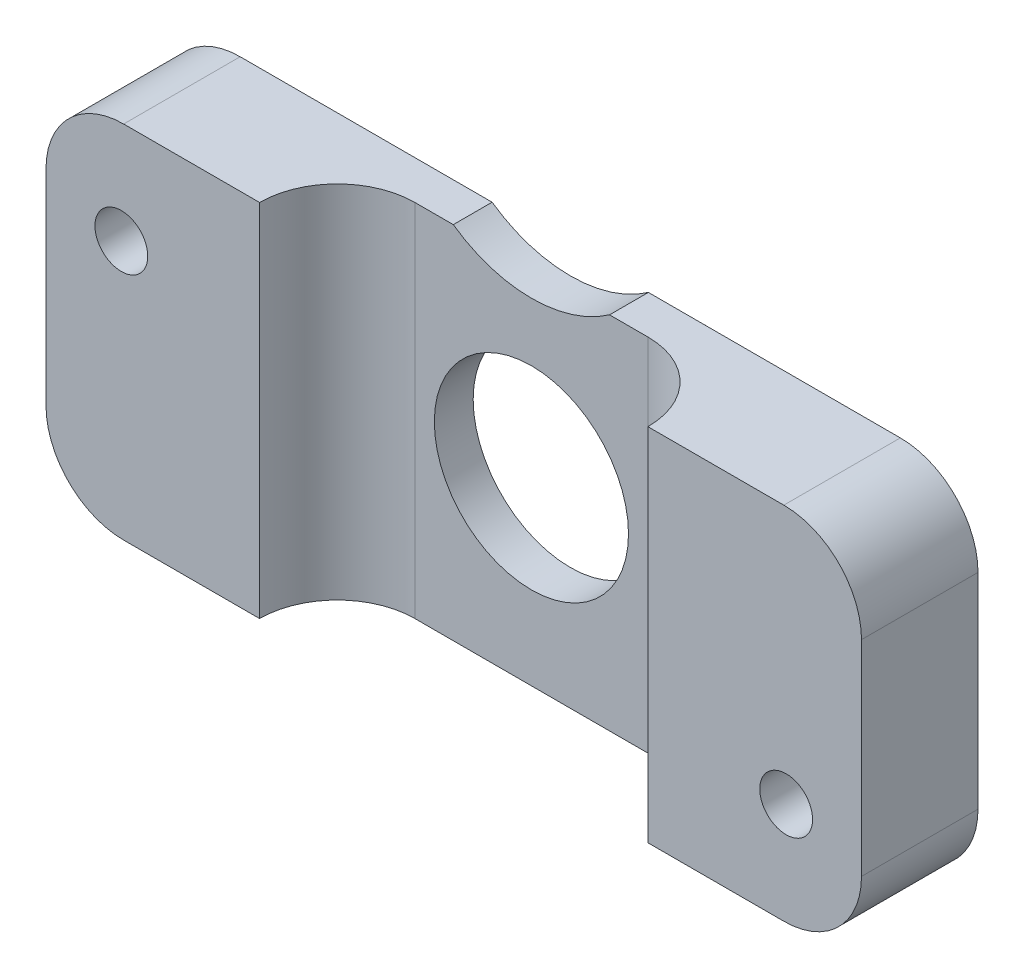
ISO-10303-21;
HEADER;
FILE_DESCRIPTION(('STEP AP214'),'2;1');
FILE_NAME('part.step','',(''),(''),'','','');
FILE_SCHEMA(('AUTOMOTIVE_DESIGN { 1 0 10303 214 1 1 1 1 }'));
ENDSEC;
DATA;
#1=APPLICATION_CONTEXT('core data for automotive mechanical design processes');
#2=APPLICATION_PROTOCOL_DEFINITION('international standard','automotive_design',2000,#1);
#3=PRODUCT_CONTEXT('',#1,'mechanical');
#4=PRODUCT('Part','Part','',(#3));
#5=PRODUCT_RELATED_PRODUCT_CATEGORY('part','',(#4));
#6=PRODUCT_DEFINITION_FORMATION('','',#4);
#7=PRODUCT_DEFINITION_CONTEXT('part definition',#1,'design');
#8=PRODUCT_DEFINITION('design','',#6,#7);
#9=PRODUCT_DEFINITION_SHAPE('','',#8);
#10=(LENGTH_UNIT() NAMED_UNIT(*) SI_UNIT(.MILLI.,.METRE.));
#11=(NAMED_UNIT(*) PLANE_ANGLE_UNIT() SI_UNIT($,.RADIAN.));
#12=(NAMED_UNIT(*) SI_UNIT($,.STERADIAN.) SOLID_ANGLE_UNIT());
#13=UNCERTAINTY_MEASURE_WITH_UNIT(LENGTH_MEASURE(1.E-05),#10,'distance_accuracy_value','');
#14=(GEOMETRIC_REPRESENTATION_CONTEXT(3) GLOBAL_UNCERTAINTY_ASSIGNED_CONTEXT((#13)) GLOBAL_UNIT_ASSIGNED_CONTEXT((#10,
#11,#12)) REPRESENTATION_CONTEXT('',''));
#15=CARTESIAN_POINT('',(0.,0.,0.));
#16=DIRECTION('',(0.,0.,1.));
#17=DIRECTION('',(1.,0.,0.));
#18=AXIS2_PLACEMENT_3D('',#15,#16,#17);
#19=CARTESIAN_POINT('',(-16.66875,7.366,1.5875));
#20=DIRECTION('',(0.,-1.,0.));
#21=DIRECTION('',(0.,0.,-1.));
#22=AXIS2_PLACEMENT_3D('',#19,#20,#21);
#23=PLANE('',#22);
#24=DIRECTION('',(-1.,0.,0.));
#25=VECTOR('',#24,1.);
#26=CARTESIAN_POINT('',(-16.66875,7.366,0.));
#27=LINE('',#26,#25);
#28=CARTESIAN_POINT('',(-3.19379750493046,7.366,0.));
#29=VERTEX_POINT('',#28);
#30=CARTESIAN_POINT('',(-13.49375,7.366,0.));
#31=VERTEX_POINT('',#30);
#32=EDGE_CURVE('E478',#29,#31,#27,.T.);
#33=ORIENTED_EDGE('',*,*,#32,.T.);
#34=DIRECTION('',(0.,0.,-1.));
#35=VECTOR('',#34,1.);
#36=CARTESIAN_POINT('',(-13.49375,7.366,1.5875));
#37=LINE('',#36,#35);
#38=CARTESIAN_POINT('',(-13.49375,7.366,4.7625));
#39=VERTEX_POINT('',#38);
#40=EDGE_CURVE('E11',#31,#39,#37,.F.);
#41=ORIENTED_EDGE('',*,*,#40,.T.);
#42=DIRECTION('',(-1.,0.,0.));
#43=VECTOR('',#42,1.);
#44=CARTESIAN_POINT('',(-7.9375,7.366,4.7625));
#45=LINE('',#44,#43);
#46=CARTESIAN_POINT('',(-7.9375,7.366,4.7625));
#47=VERTEX_POINT('',#46);
#48=EDGE_CURVE('E627',#47,#39,#45,.T.);
#49=ORIENTED_EDGE('',*,*,#48,.F.);
#50=CARTESIAN_POINT('',(-4.7625,7.366,4.7625));
#51=DIRECTION('',(0.,-1.,0.));
#52=DIRECTION('',(0.,0.,-1.));
#53=AXIS2_PLACEMENT_3D('',#50,#51,#52);
#54=CIRCLE('',#53,3.175);
#55=CARTESIAN_POINT('',(-4.7625,7.366,1.5875));
#56=VERTEX_POINT('',#55);
#57=EDGE_CURVE('E509',#47,#56,#54,.T.);
#58=ORIENTED_EDGE('',*,*,#57,.T.);
#59=DIRECTION('',(-1.,0.,0.));
#60=VECTOR('',#59,1.);
#61=CARTESIAN_POINT('',(-16.66875,7.366,1.5875));
#62=LINE('',#61,#60);
#63=CARTESIAN_POINT('',(-3.19379750493046,7.366,1.5875));
#64=VERTEX_POINT('',#63);
#65=EDGE_CURVE('E481',#64,#56,#62,.T.);
#66=ORIENTED_EDGE('',*,*,#65,.F.);
#67=DIRECTION('',(0.,0.,-1.));
#68=VECTOR('',#67,1.);
#69=CARTESIAN_POINT('',(-3.19379750493046,7.366,4.763525));
#70=LINE('',#69,#68);
#71=EDGE_CURVE('E466',#29,#64,#70,.F.);
#72=ORIENTED_EDGE('',*,*,#71,.F.);
#73=EDGE_LOOP('',(#33,#41,#49,#58,#66,#72));
#74=FACE_BOUND('',#73,.T.);
#75=ADVANCED_FACE('F360',(#74),#23,.F.);
#76=CARTESIAN_POINT('',(-16.66875,-7.366,1.5875));
#77=DIRECTION('',(0.,0.,1.));
#78=DIRECTION('',(1.,0.,0.));
#79=AXIS2_PLACEMENT_3D('',#76,#77,#78);
#80=PLANE('',#79);
#81=ORIENTED_EDGE('',*,*,#65,.T.);
#82=DIRECTION('',(0.,1.,0.));
#83=VECTOR('',#82,1.);
#84=CARTESIAN_POINT('',(-4.7625,-7.366,1.5875));
#85=LINE('',#84,#83);
#86=CARTESIAN_POINT('',(-4.7625,-7.366,1.5875));
#87=VERTEX_POINT('',#86);
#88=EDGE_CURVE('E507',#56,#87,#85,.F.);
#89=ORIENTED_EDGE('',*,*,#88,.T.);
#90=DIRECTION('',(1.,0.,0.));
#91=VECTOR('',#90,1.);
#92=CARTESIAN_POINT('',(-16.66875,-7.366,1.5875));
#93=LINE('',#92,#91);
#94=CARTESIAN_POINT('',(4.7625,-7.366,1.5875));
#95=VERTEX_POINT('',#94);
#96=EDGE_CURVE('E491',#87,#95,#93,.T.);
#97=ORIENTED_EDGE('',*,*,#96,.T.);
#98=DIRECTION('',(0.,-1.,0.));
#99=VECTOR('',#98,1.);
#100=CARTESIAN_POINT('',(4.76250000000001,-7.36599999999999,1.5875));
#101=LINE('',#100,#99);
#102=CARTESIAN_POINT('',(4.7625,7.366,1.5875));
#103=VERTEX_POINT('',#102);
#104=EDGE_CURVE('E505',#95,#103,#101,.F.);
#105=ORIENTED_EDGE('',*,*,#104,.T.);
#106=CARTESIAN_POINT('',(3.19379750493046,7.366,1.5875));
#107=VERTEX_POINT('',#106);
#108=EDGE_CURVE('E503',#103,#107,#62,.T.);
#109=ORIENTED_EDGE('',*,*,#108,.T.);
#110=CARTESIAN_POINT('',(0.,11.9126,1.5875));
#111=DIRECTION('',(0.,0.,1.));
#112=DIRECTION('',(1.,0.,0.));
#113=AXIS2_PLACEMENT_3D('',#110,#111,#112);
#114=CIRCLE('',#113,5.55625);
#115=EDGE_CURVE('E473',#107,#64,#114,.F.);
#116=ORIENTED_EDGE('',*,*,#115,.T.);
#117=EDGE_LOOP('',(#81,#89,#97,#105,#109,#116));
#118=FACE_BOUND('',#117,.T.);
#119=CARTESIAN_POINT('',(0.,0.,1.5875));
#120=DIRECTION('',(0.,0.,1.));
#121=DIRECTION('',(1.,0.,0.));
#122=AXIS2_PLACEMENT_3D('',#119,#120,#121);
#123=CIRCLE('',#122,3.96875);
#124=CARTESIAN_POINT('',(3.96875,0.,1.5875));
#125=VERTEX_POINT('',#124);
#126=EDGE_CURVE('E619',#125,#125,#123,.T.);
#127=ORIENTED_EDGE('',*,*,#126,.F.);
#128=EDGE_LOOP('',(#127));
#129=FACE_BOUND('',#128,.T.);
#130=ADVANCED_FACE('F570',(#118,#129),#80,.T.);
#131=CARTESIAN_POINT('',(-16.66875,-7.366,0.));
#132=DIRECTION('',(0.,0.,1.));
#133=DIRECTION('',(1.,0.,0.));
#134=AXIS2_PLACEMENT_3D('',#131,#132,#133);
#135=PLANE('',#134);
#136=CARTESIAN_POINT('',(-13.589,3.175,0.));
#137=DIRECTION('',(0.,0.,-1.));
#138=DIRECTION('',(-1.,0.,0.));
#139=AXIS2_PLACEMENT_3D('',#136,#137,#138);
#140=CIRCLE('',#139,1.0795);
#141=CARTESIAN_POINT('',(-14.6685,3.175,0.));
#142=VERTEX_POINT('',#141);
#143=EDGE_CURVE('E645',#142,#142,#140,.T.);
#144=ORIENTED_EDGE('',*,*,#143,.F.);
#145=EDGE_LOOP('',(#144));
#146=FACE_BOUND('',#145,.T.);
#147=CARTESIAN_POINT('',(13.589,-3.175,0.));
#148=DIRECTION('',(0.,0.,-1.));
#149=DIRECTION('',(-1.,0.,0.));
#150=AXIS2_PLACEMENT_3D('',#147,#148,#149);
#151=CIRCLE('',#150,1.0795);
#152=CARTESIAN_POINT('',(12.5095,-3.175,0.));
#153=VERTEX_POINT('',#152);
#154=EDGE_CURVE('E641',#153,#153,#151,.T.);
#155=ORIENTED_EDGE('',*,*,#154,.F.);
#156=EDGE_LOOP('',(#155));
#157=FACE_BOUND('',#156,.T.);
#158=DIRECTION('',(1.,0.,0.));
#159=VECTOR('',#158,1.);
#160=CARTESIAN_POINT('',(-16.66875,-7.366,0.));
#161=LINE('',#160,#159);
#162=CARTESIAN_POINT('',(-13.49375,-7.366,0.));
#163=VERTEX_POINT('',#162);
#164=CARTESIAN_POINT('',(13.49375,-7.366,0.));
#165=VERTEX_POINT('',#164);
#166=EDGE_CURVE('E492',#163,#165,#161,.T.);
#167=ORIENTED_EDGE('',*,*,#166,.F.);
#168=CARTESIAN_POINT('',(-13.49375,-4.191,0.));
#169=DIRECTION('',(0.,0.,1.));
#170=DIRECTION('',(1.,0.,0.));
#171=AXIS2_PLACEMENT_3D('',#168,#169,#170);
#172=CIRCLE('',#171,3.175);
#173=CARTESIAN_POINT('',(-16.66875,-4.191,0.));
#174=VERTEX_POINT('',#173);
#175=EDGE_CURVE('E529',#163,#174,#172,.F.);
#176=ORIENTED_EDGE('',*,*,#175,.T.);
#177=DIRECTION('',(0.,-1.,0.));
#178=VECTOR('',#177,1.);
#179=CARTESIAN_POINT('',(-16.66875,7.366,0.));
#180=LINE('',#179,#178);
#181=CARTESIAN_POINT('',(-16.66875,4.191,0.));
#182=VERTEX_POINT('',#181);
#183=EDGE_CURVE('E615',#182,#174,#180,.T.);
#184=ORIENTED_EDGE('',*,*,#183,.F.);
#185=CARTESIAN_POINT('',(-13.49375,4.191,0.));
#186=DIRECTION('',(0.,0.,1.));
#187=DIRECTION('',(1.,0.,0.));
#188=AXIS2_PLACEMENT_3D('',#185,#186,#187);
#189=CIRCLE('',#188,3.175);
#190=EDGE_CURVE('E487',#182,#31,#189,.F.);
#191=ORIENTED_EDGE('',*,*,#190,.T.);
#192=ORIENTED_EDGE('',*,*,#32,.F.);
#193=CARTESIAN_POINT('',(0.,11.9126,0.));
#194=DIRECTION('',(0.,0.,-1.));
#195=DIRECTION('',(-1.,0.,0.));
#196=AXIS2_PLACEMENT_3D('',#193,#194,#195);
#197=CIRCLE('',#196,5.55625);
#198=CARTESIAN_POINT('',(3.19379750493046,7.366,0.));
#199=VERTEX_POINT('',#198);
#200=EDGE_CURVE('E462',#199,#29,#197,.T.);
#201=ORIENTED_EDGE('',*,*,#200,.F.);
#202=CARTESIAN_POINT('',(13.49375,7.366,0.));
#203=VERTEX_POINT('',#202);
#204=EDGE_CURVE('E488',#203,#199,#27,.T.);
#205=ORIENTED_EDGE('',*,*,#204,.F.);
#206=CARTESIAN_POINT('',(13.49375,4.191,0.));
#207=DIRECTION('',(0.,0.,1.));
#208=DIRECTION('',(1.,0.,0.));
#209=AXIS2_PLACEMENT_3D('',#206,#207,#208);
#210=CIRCLE('',#209,3.175);
#211=CARTESIAN_POINT('',(16.66875,4.191,0.));
#212=VERTEX_POINT('',#211);
#213=EDGE_CURVE('E525',#203,#212,#210,.F.);
#214=ORIENTED_EDGE('',*,*,#213,.T.);
#215=DIRECTION('',(0.,1.,0.));
#216=VECTOR('',#215,1.);
#217=CARTESIAN_POINT('',(16.66875,7.366,0.));
#218=LINE('',#217,#216);
#219=CARTESIAN_POINT('',(16.66875,-4.191,0.));
#220=VERTEX_POINT('',#219);
#221=EDGE_CURVE('E489',#220,#212,#218,.T.);
#222=ORIENTED_EDGE('',*,*,#221,.F.);
#223=CARTESIAN_POINT('',(13.49375,-4.191,0.));
#224=DIRECTION('',(0.,0.,1.));
#225=DIRECTION('',(1.,0.,0.));
#226=AXIS2_PLACEMENT_3D('',#223,#224,#225);
#227=CIRCLE('',#226,3.175);
#228=EDGE_CURVE('E527',#220,#165,#227,.F.);
#229=ORIENTED_EDGE('',*,*,#228,.T.);
#230=EDGE_LOOP('',(#167,#176,#184,#191,#192,#201,#205,#214,#222,#229));
#231=FACE_BOUND('',#230,.T.);
#232=CARTESIAN_POINT('',(0.,0.,0.));
#233=DIRECTION('',(0.,0.,1.));
#234=DIRECTION('',(1.,0.,0.));
#235=AXIS2_PLACEMENT_3D('',#232,#233,#234);
#236=CIRCLE('',#235,3.96875);
#237=CARTESIAN_POINT('',(3.96875,0.,0.));
#238=VERTEX_POINT('',#237);
#239=EDGE_CURVE('E622',#238,#238,#236,.T.);
#240=ORIENTED_EDGE('',*,*,#239,.T.);
#241=EDGE_LOOP('',(#240));
#242=FACE_BOUND('',#241,.T.);
#243=ADVANCED_FACE('F484',(#146,#157,#231,#242),#135,.F.);
#244=CARTESIAN_POINT('',(-16.66875,7.366,1.5875));
#245=DIRECTION('',(1.,0.,0.));
#246=DIRECTION('',(0.,0.,-1.));
#247=AXIS2_PLACEMENT_3D('',#244,#245,#246);
#248=PLANE('',#247);
#249=ORIENTED_EDGE('',*,*,#183,.T.);
#250=DIRECTION('',(0.,0.,-1.));
#251=VECTOR('',#250,1.);
#252=CARTESIAN_POINT('',(-16.66875,-4.191,1.5875));
#253=LINE('',#252,#251);
#254=CARTESIAN_POINT('',(-16.66875,-4.191,4.7625));
#255=VERTEX_POINT('',#254);
#256=EDGE_CURVE('E534',#174,#255,#253,.F.);
#257=ORIENTED_EDGE('',*,*,#256,.T.);
#258=DIRECTION('',(0.,-1.,0.));
#259=VECTOR('',#258,1.);
#260=CARTESIAN_POINT('',(-16.66875,7.366,4.7625));
#261=LINE('',#260,#259);
#262=CARTESIAN_POINT('',(-16.66875,4.191,4.7625));
#263=VERTEX_POINT('',#262);
#264=EDGE_CURVE('E609',#263,#255,#261,.T.);
#265=ORIENTED_EDGE('',*,*,#264,.F.);
#266=DIRECTION('',(0.,0.,-1.));
#267=VECTOR('',#266,1.);
#268=CARTESIAN_POINT('',(-16.66875,4.191,1.5875));
#269=LINE('',#268,#267);
#270=EDGE_CURVE('E531',#263,#182,#269,.T.);
#271=ORIENTED_EDGE('',*,*,#270,.T.);
#272=EDGE_LOOP('',(#249,#257,#265,#271));
#273=FACE_BOUND('',#272,.T.);
#274=ADVANCED_FACE('F362',(#273),#248,.F.);
#275=CARTESIAN_POINT('',(-16.66875,-7.366,1.5875));
#276=DIRECTION('',(0.,1.,0.));
#277=DIRECTION('',(0.,0.,1.));
#278=AXIS2_PLACEMENT_3D('',#275,#276,#277);
#279=PLANE('',#278);
#280=DIRECTION('',(1.,0.,0.));
#281=VECTOR('',#280,1.);
#282=CARTESIAN_POINT('',(-16.66875,-7.366,4.7625));
#283=LINE('',#282,#281);
#284=CARTESIAN_POINT('',(-13.49375,-7.366,4.7625));
#285=VERTEX_POINT('',#284);
#286=CARTESIAN_POINT('',(-7.9375,-7.366,4.7625));
#287=VERTEX_POINT('',#286);
#288=EDGE_CURVE('E600',#285,#287,#283,.T.);
#289=ORIENTED_EDGE('',*,*,#288,.F.);
#290=DIRECTION('',(0.,0.,-1.));
#291=VECTOR('',#290,1.);
#292=CARTESIAN_POINT('',(-13.49375,-7.366,1.5875));
#293=LINE('',#292,#291);
#294=EDGE_CURVE('E521',#285,#163,#293,.T.);
#295=ORIENTED_EDGE('',*,*,#294,.T.);
#296=ORIENTED_EDGE('',*,*,#166,.T.);
#297=DIRECTION('',(0.,0.,-1.));
#298=VECTOR('',#297,1.);
#299=CARTESIAN_POINT('',(13.49375,-7.366,1.5875));
#300=LINE('',#299,#298);
#301=CARTESIAN_POINT('',(13.49375,-7.366,4.7625));
#302=VERTEX_POINT('',#301);
#303=EDGE_CURVE('E519',#165,#302,#300,.F.);
#304=ORIENTED_EDGE('',*,*,#303,.T.);
#305=DIRECTION('',(1.,0.,0.));
#306=VECTOR('',#305,1.);
#307=CARTESIAN_POINT('',(7.9375,-7.366,4.7625));
#308=LINE('',#307,#306);
#309=CARTESIAN_POINT('',(7.9375,-7.366,4.7625));
#310=VERTEX_POINT('',#309);
#311=EDGE_CURVE('E632',#310,#302,#308,.T.);
#312=ORIENTED_EDGE('',*,*,#311,.F.);
#313=CARTESIAN_POINT('',(4.7625,-7.366,4.7625));
#314=DIRECTION('',(0.,1.,0.));
#315=DIRECTION('',(0.,0.,1.));
#316=AXIS2_PLACEMENT_3D('',#313,#314,#315);
#317=CIRCLE('',#316,3.175);
#318=EDGE_CURVE('E514',#310,#95,#317,.T.);
#319=ORIENTED_EDGE('',*,*,#318,.T.);
#320=ORIENTED_EDGE('',*,*,#96,.F.);
#321=CARTESIAN_POINT('',(-4.7625,-7.366,4.7625));
#322=DIRECTION('',(0.,1.,0.));
#323=DIRECTION('',(0.,0.,1.));
#324=AXIS2_PLACEMENT_3D('',#321,#322,#323);
#325=CIRCLE('',#324,3.175);
#326=EDGE_CURVE('E511',#87,#287,#325,.T.);
#327=ORIENTED_EDGE('',*,*,#326,.T.);
#328=EDGE_LOOP('',(#289,#295,#296,#304,#312,#319,#320,#327));
#329=FACE_BOUND('',#328,.T.);
#330=ADVANCED_FACE('F590',(#329),#279,.F.);
#331=CARTESIAN_POINT('',(16.66875,7.366,1.5875));
#332=DIRECTION('',(-1.,0.,0.));
#333=DIRECTION('',(0.,0.,1.));
#334=AXIS2_PLACEMENT_3D('',#331,#332,#333);
#335=PLANE('',#334);
#336=DIRECTION('',(0.,1.,0.));
#337=VECTOR('',#336,1.);
#338=CARTESIAN_POINT('',(16.66875,-7.366,4.7625));
#339=LINE('',#338,#337);
#340=CARTESIAN_POINT('',(16.66875,-4.191,4.7625));
#341=VERTEX_POINT('',#340);
#342=CARTESIAN_POINT('',(16.66875,4.191,4.7625));
#343=VERTEX_POINT('',#342);
#344=EDGE_CURVE('E639',#341,#343,#339,.T.);
#345=ORIENTED_EDGE('',*,*,#344,.F.);
#346=DIRECTION('',(0.,0.,-1.));
#347=VECTOR('',#346,1.);
#348=CARTESIAN_POINT('',(16.66875,-4.191,1.5875));
#349=LINE('',#348,#347);
#350=EDGE_CURVE('E541',#341,#220,#349,.T.);
#351=ORIENTED_EDGE('',*,*,#350,.T.);
#352=ORIENTED_EDGE('',*,*,#221,.T.);
#353=DIRECTION('',(0.,0.,-1.));
#354=VECTOR('',#353,1.);
#355=CARTESIAN_POINT('',(16.66875,4.191,1.5875));
#356=LINE('',#355,#354);
#357=EDGE_CURVE('E383',#212,#343,#356,.F.);
#358=ORIENTED_EDGE('',*,*,#357,.T.);
#359=EDGE_LOOP('',(#345,#351,#352,#358));
#360=FACE_BOUND('',#359,.T.);
#361=ADVANCED_FACE('F553',(#360),#335,.F.);
#362=DIRECTION('',(-1.,0.,0.));
#363=VECTOR('',#362,1.);
#364=CARTESIAN_POINT('',(16.66875,7.366,4.7625));
#365=LINE('',#364,#363);
#366=CARTESIAN_POINT('',(13.49375,7.366,4.7625));
#367=VERTEX_POINT('',#366);
#368=CARTESIAN_POINT('',(7.9375,7.366,4.7625));
#369=VERTEX_POINT('',#368);
#370=EDGE_CURVE('E550',#367,#369,#365,.T.);
#371=ORIENTED_EDGE('',*,*,#370,.F.);
#372=DIRECTION('',(0.,0.,-1.));
#373=VECTOR('',#372,1.);
#374=CARTESIAN_POINT('',(13.49375,7.366,1.5875));
#375=LINE('',#374,#373);
#376=EDGE_CURVE('E368',#367,#203,#375,.T.);
#377=ORIENTED_EDGE('',*,*,#376,.T.);
#378=ORIENTED_EDGE('',*,*,#204,.T.);
#379=DIRECTION('',(0.,0.,-1.));
#380=VECTOR('',#379,1.);
#381=CARTESIAN_POINT('',(3.19379750493046,7.366,4.763525));
#382=LINE('',#381,#380);
#383=EDGE_CURVE('E469',#107,#199,#382,.T.);
#384=ORIENTED_EDGE('',*,*,#383,.F.);
#385=ORIENTED_EDGE('',*,*,#108,.F.);
#386=CARTESIAN_POINT('',(4.7625,7.366,4.7625));
#387=DIRECTION('',(0.,-1.,0.));
#388=DIRECTION('',(0.,0.,-1.));
#389=AXIS2_PLACEMENT_3D('',#386,#387,#388);
#390=CIRCLE('',#389,3.175);
#391=EDGE_CURVE('E516',#103,#369,#390,.T.);
#392=ORIENTED_EDGE('',*,*,#391,.T.);
#393=EDGE_LOOP('',(#371,#377,#378,#384,#385,#392));
#394=FACE_BOUND('',#393,.T.);
#395=ADVANCED_FACE('F549',(#394),#23,.F.);
#396=CARTESIAN_POINT('',(0.,0.,1.5875));
#397=DIRECTION('',(0.,0.,-1.));
#398=DIRECTION('',(-1.,0.,0.));
#399=AXIS2_PLACEMENT_3D('',#396,#397,#398);
#400=CYLINDRICAL_SURFACE('',#399,3.96875);
#401=ORIENTED_EDGE('',*,*,#126,.T.);
#402=EDGE_LOOP('',(#401));
#403=FACE_BOUND('',#402,.T.);
#404=ORIENTED_EDGE('',*,*,#239,.F.);
#405=EDGE_LOOP('',(#404));
#406=FACE_BOUND('',#405,.T.);
#407=ADVANCED_FACE('F581',(#403,#406),#400,.F.);
#408=CARTESIAN_POINT('',(-16.66875,-7.366,4.7625));
#409=DIRECTION('',(0.,0.,1.));
#410=DIRECTION('',(1.,0.,0.));
#411=AXIS2_PLACEMENT_3D('',#408,#409,#410);
#412=PLANE('',#411);
#413=CARTESIAN_POINT('',(-13.589,3.175,4.7625));
#414=DIRECTION('',(0.,0.,1.));
#415=DIRECTION('',(1.,0.,0.));
#416=AXIS2_PLACEMENT_3D('',#413,#414,#415);
#417=CIRCLE('',#416,1.0795);
#418=CARTESIAN_POINT('',(-12.5095,3.175,4.7625));
#419=VERTEX_POINT('',#418);
#420=EDGE_CURVE('E648',#419,#419,#417,.F.);
#421=ORIENTED_EDGE('',*,*,#420,.T.);
#422=EDGE_LOOP('',(#421));
#423=FACE_BOUND('',#422,.T.);
#424=ORIENTED_EDGE('',*,*,#264,.T.);
#425=CARTESIAN_POINT('',(-13.49375,-4.191,4.7625));
#426=DIRECTION('',(0.,0.,1.));
#427=DIRECTION('',(1.,0.,0.));
#428=AXIS2_PLACEMENT_3D('',#425,#426,#427);
#429=CIRCLE('',#428,3.175);
#430=EDGE_CURVE('E538',#255,#285,#429,.T.);
#431=ORIENTED_EDGE('',*,*,#430,.T.);
#432=ORIENTED_EDGE('',*,*,#288,.T.);
#433=DIRECTION('',(0.,1.,0.));
#434=VECTOR('',#433,1.);
#435=CARTESIAN_POINT('',(-7.9375,7.366,4.7625));
#436=LINE('',#435,#434);
#437=EDGE_CURVE('E608',#287,#47,#436,.T.);
#438=ORIENTED_EDGE('',*,*,#437,.T.);
#439=ORIENTED_EDGE('',*,*,#48,.T.);
#440=CARTESIAN_POINT('',(-13.49375,4.191,4.7625));
#441=DIRECTION('',(0.,0.,1.));
#442=DIRECTION('',(1.,0.,0.));
#443=AXIS2_PLACEMENT_3D('',#440,#441,#442);
#444=CIRCLE('',#443,3.175);
#445=EDGE_CURVE('E536',#39,#263,#444,.T.);
#446=ORIENTED_EDGE('',*,*,#445,.T.);
#447=EDGE_LOOP('',(#424,#431,#432,#438,#439,#446));
#448=FACE_BOUND('',#447,.T.);
#449=ADVANCED_FACE('F587',(#423,#448),#412,.T.);
#450=CARTESIAN_POINT('',(16.66875,7.366,4.7625));
#451=DIRECTION('',(0.,0.,1.));
#452=DIRECTION('',(1.,0.,0.));
#453=AXIS2_PLACEMENT_3D('',#450,#451,#452);
#454=PLANE('',#453);
#455=CARTESIAN_POINT('',(13.589,-3.175,4.7625));
#456=DIRECTION('',(0.,0.,1.));
#457=DIRECTION('',(1.,0.,0.));
#458=AXIS2_PLACEMENT_3D('',#455,#456,#457);
#459=CIRCLE('',#458,1.0795);
#460=CARTESIAN_POINT('',(14.6685,-3.175,4.7625));
#461=VERTEX_POINT('',#460);
#462=EDGE_CURVE('E642',#461,#461,#459,.F.);
#463=ORIENTED_EDGE('',*,*,#462,.T.);
#464=EDGE_LOOP('',(#463));
#465=FACE_BOUND('',#464,.T.);
#466=ORIENTED_EDGE('',*,*,#311,.T.);
#467=CARTESIAN_POINT('',(13.49375,-4.191,4.7625));
#468=DIRECTION('',(0.,0.,1.));
#469=DIRECTION('',(1.,0.,0.));
#470=AXIS2_PLACEMENT_3D('',#467,#468,#469);
#471=CIRCLE('',#470,3.175);
#472=EDGE_CURVE('E545',#302,#341,#471,.T.);
#473=ORIENTED_EDGE('',*,*,#472,.T.);
#474=ORIENTED_EDGE('',*,*,#344,.T.);
#475=CARTESIAN_POINT('',(13.49375,4.191,4.7625));
#476=DIRECTION('',(0.,0.,1.));
#477=DIRECTION('',(1.,0.,0.));
#478=AXIS2_PLACEMENT_3D('',#475,#476,#477);
#479=CIRCLE('',#478,3.175);
#480=EDGE_CURVE('E375',#343,#367,#479,.T.);
#481=ORIENTED_EDGE('',*,*,#480,.T.);
#482=ORIENTED_EDGE('',*,*,#370,.T.);
#483=DIRECTION('',(0.,-1.,0.));
#484=VECTOR('',#483,1.);
#485=CARTESIAN_POINT('',(7.9375,7.366,4.7625));
#486=LINE('',#485,#484);
#487=EDGE_CURVE('E635',#369,#310,#486,.T.);
#488=ORIENTED_EDGE('',*,*,#487,.T.);
#489=EDGE_LOOP('',(#466,#473,#474,#481,#482,#488));
#490=FACE_BOUND('',#489,.T.);
#491=ADVANCED_FACE('F663',(#465,#490),#454,.T.);
#492=CARTESIAN_POINT('',(13.589,-3.175,4.763525));
#493=DIRECTION('',(0.,0.,-1.));
#494=DIRECTION('',(-1.,0.,0.));
#495=AXIS2_PLACEMENT_3D('',#492,#493,#494);
#496=CYLINDRICAL_SURFACE('',#495,1.0795);
#497=ORIENTED_EDGE('',*,*,#462,.F.);
#498=EDGE_LOOP('',(#497));
#499=FACE_BOUND('',#498,.T.);
#500=ORIENTED_EDGE('',*,*,#154,.T.);
#501=EDGE_LOOP('',(#500));
#502=FACE_BOUND('',#501,.T.);
#503=ADVANCED_FACE('F675',(#499,#502),#496,.F.);
#504=CARTESIAN_POINT('',(-13.589,3.175,4.763525));
#505=DIRECTION('',(0.,0.,-1.));
#506=DIRECTION('',(-1.,0.,0.));
#507=AXIS2_PLACEMENT_3D('',#504,#505,#506);
#508=CYLINDRICAL_SURFACE('',#507,1.0795);
#509=ORIENTED_EDGE('',*,*,#420,.F.);
#510=EDGE_LOOP('',(#509));
#511=FACE_BOUND('',#510,.T.);
#512=ORIENTED_EDGE('',*,*,#143,.T.);
#513=EDGE_LOOP('',(#512));
#514=FACE_BOUND('',#513,.T.);
#515=ADVANCED_FACE('F688',(#511,#514),#508,.F.);
#516=CARTESIAN_POINT('',(0.,11.9126,4.763525));
#517=DIRECTION('',(0.,0.,-1.));
#518=DIRECTION('',(-1.,0.,0.));
#519=AXIS2_PLACEMENT_3D('',#516,#517,#518);
#520=CYLINDRICAL_SURFACE('',#519,5.55625);
#521=ORIENTED_EDGE('',*,*,#71,.T.);
#522=ORIENTED_EDGE('',*,*,#115,.F.);
#523=ORIENTED_EDGE('',*,*,#383,.T.);
#524=ORIENTED_EDGE('',*,*,#200,.T.);
#525=EDGE_LOOP('',(#521,#522,#523,#524));
#526=FACE_BOUND('',#525,.T.);
#527=ADVANCED_FACE('F464',(#526),#520,.F.);
#528=CARTESIAN_POINT('',(-4.7625,7.366,4.7625));
#529=DIRECTION('',(0.,1.,0.));
#530=DIRECTION('',(-1.,0.,0.));
#531=AXIS2_PLACEMENT_3D('',#528,#529,#530);
#532=CYLINDRICAL_SURFACE('',#531,3.175);
#533=ORIENTED_EDGE('',*,*,#326,.F.);
#534=ORIENTED_EDGE('',*,*,#88,.F.);
#535=ORIENTED_EDGE('',*,*,#57,.F.);
#536=ORIENTED_EDGE('',*,*,#437,.F.);
#537=EDGE_LOOP('',(#533,#534,#535,#536));
#538=FACE_BOUND('',#537,.T.);
#539=ADVANCED_FACE('F667',(#538),#532,.F.);
#540=CARTESIAN_POINT('',(4.7625,7.366,4.7625));
#541=DIRECTION('',(0.,-1.,0.));
#542=DIRECTION('',(1.,0.,0.));
#543=AXIS2_PLACEMENT_3D('',#540,#541,#542);
#544=CYLINDRICAL_SURFACE('',#543,3.175);
#545=ORIENTED_EDGE('',*,*,#391,.F.);
#546=ORIENTED_EDGE('',*,*,#104,.F.);
#547=ORIENTED_EDGE('',*,*,#318,.F.);
#548=ORIENTED_EDGE('',*,*,#487,.F.);
#549=EDGE_LOOP('',(#545,#546,#547,#548));
#550=FACE_BOUND('',#549,.T.);
#551=ADVANCED_FACE('F661',(#550),#544,.F.);
#552=CARTESIAN_POINT('',(-13.49375,-4.191,1.5875));
#553=DIRECTION('',(0.,0.,-1.));
#554=DIRECTION('',(-1.,0.,0.));
#555=AXIS2_PLACEMENT_3D('',#552,#553,#554);
#556=CYLINDRICAL_SURFACE('',#555,3.175);
#557=ORIENTED_EDGE('',*,*,#430,.F.);
#558=ORIENTED_EDGE('',*,*,#256,.F.);
#559=ORIENTED_EDGE('',*,*,#175,.F.);
#560=ORIENTED_EDGE('',*,*,#294,.F.);
#561=EDGE_LOOP('',(#557,#558,#559,#560));
#562=FACE_BOUND('',#561,.T.);
#563=ADVANCED_FACE('F566',(#562),#556,.T.);
#564=CARTESIAN_POINT('',(13.49375,-4.191,1.5875));
#565=DIRECTION('',(0.,0.,-1.));
#566=DIRECTION('',(-1.,0.,0.));
#567=AXIS2_PLACEMENT_3D('',#564,#565,#566);
#568=CYLINDRICAL_SURFACE('',#567,3.175);
#569=ORIENTED_EDGE('',*,*,#472,.F.);
#570=ORIENTED_EDGE('',*,*,#303,.F.);
#571=ORIENTED_EDGE('',*,*,#228,.F.);
#572=ORIENTED_EDGE('',*,*,#350,.F.);
#573=EDGE_LOOP('',(#569,#570,#571,#572));
#574=FACE_BOUND('',#573,.T.);
#575=ADVANCED_FACE('F558',(#574),#568,.T.);
#576=CARTESIAN_POINT('',(13.49375,4.191,1.5875));
#577=DIRECTION('',(0.,0.,-1.));
#578=DIRECTION('',(-1.,0.,0.));
#579=AXIS2_PLACEMENT_3D('',#576,#577,#578);
#580=CYLINDRICAL_SURFACE('',#579,3.175);
#581=ORIENTED_EDGE('',*,*,#480,.F.);
#582=ORIENTED_EDGE('',*,*,#357,.F.);
#583=ORIENTED_EDGE('',*,*,#213,.F.);
#584=ORIENTED_EDGE('',*,*,#376,.F.);
#585=EDGE_LOOP('',(#581,#582,#583,#584));
#586=FACE_BOUND('',#585,.T.);
#587=ADVANCED_FACE('F555',(#586),#580,.T.);
#588=CARTESIAN_POINT('',(-13.49375,4.191,1.5875));
#589=DIRECTION('',(0.,0.,-1.));
#590=DIRECTION('',(-1.,0.,0.));
#591=AXIS2_PLACEMENT_3D('',#588,#589,#590);
#592=CYLINDRICAL_SURFACE('',#591,3.175);
#593=ORIENTED_EDGE('',*,*,#445,.F.);
#594=ORIENTED_EDGE('',*,*,#40,.F.);
#595=ORIENTED_EDGE('',*,*,#190,.F.);
#596=ORIENTED_EDGE('',*,*,#270,.F.);
#597=EDGE_LOOP('',(#593,#594,#595,#596));
#598=FACE_BOUND('',#597,.T.);
#599=ADVANCED_FACE('F557',(#598),#592,.T.);
#600=CLOSED_SHELL('',(#75,#130,#243,#274,#330,#361,#395,#407,#449,#491,#503,#515,#527,#539,#551,
#563,#575,#587,#599));
#601=MANIFOLD_SOLID_BREP('B2',#600);
#602=ADVANCED_BREP_SHAPE_REPRESENTATION('',(#18,#601),#14);
#603=SHAPE_DEFINITION_REPRESENTATION(#9,#602);
ENDSEC;
END-ISO-10303-21;
